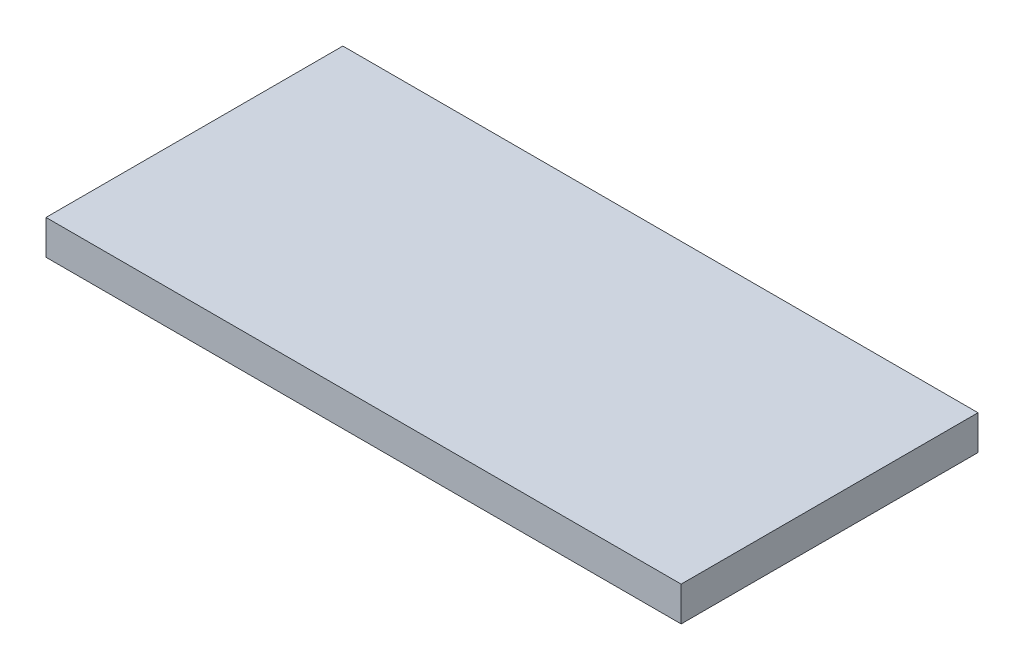
ISO-10303-21;
HEADER;
FILE_DESCRIPTION(('STEP AP214'),'2;1');
FILE_NAME('part.step','',(''),(''),'','','');
FILE_SCHEMA(('AUTOMOTIVE_DESIGN { 1 0 10303 214 1 1 1 1 }'));
ENDSEC;
DATA;
#1=APPLICATION_CONTEXT('core data for automotive mechanical design processes');
#2=APPLICATION_PROTOCOL_DEFINITION('international standard','automotive_design',2000,#1);
#3=PRODUCT_CONTEXT('',#1,'mechanical');
#4=PRODUCT('Part','Part','',(#3));
#5=PRODUCT_RELATED_PRODUCT_CATEGORY('part','',(#4));
#6=PRODUCT_DEFINITION_FORMATION('','',#4);
#7=PRODUCT_DEFINITION_CONTEXT('part definition',#1,'design');
#8=PRODUCT_DEFINITION('design','',#6,#7);
#9=PRODUCT_DEFINITION_SHAPE('','',#8);
#10=(LENGTH_UNIT() NAMED_UNIT(*) SI_UNIT(.MILLI.,.METRE.));
#11=(NAMED_UNIT(*) PLANE_ANGLE_UNIT() SI_UNIT($,.RADIAN.));
#12=(NAMED_UNIT(*) SI_UNIT($,.STERADIAN.) SOLID_ANGLE_UNIT());
#13=UNCERTAINTY_MEASURE_WITH_UNIT(LENGTH_MEASURE(1.E-05),#10,'distance_accuracy_value','');
#14=(GEOMETRIC_REPRESENTATION_CONTEXT(3) GLOBAL_UNCERTAINTY_ASSIGNED_CONTEXT((#13)) GLOBAL_UNIT_ASSIGNED_CONTEXT((#10,
#11,#12)) REPRESENTATION_CONTEXT('',''));
#15=CARTESIAN_POINT('',(0.,0.,0.));
#16=DIRECTION('',(0.,0.,1.));
#17=DIRECTION('',(1.,0.,0.));
#18=AXIS2_PLACEMENT_3D('',#15,#16,#17);
#19=CARTESIAN_POINT('',(92.,10.,-43.));
#20=DIRECTION('',(1.,0.,0.));
#21=DIRECTION('',(0.,0.,-1.));
#22=AXIS2_PLACEMENT_3D('',#19,#20,#21);
#23=PLANE('',#22);
#24=DIRECTION('',(0.,0.,1.));
#25=VECTOR('',#24,1.);
#26=CARTESIAN_POINT('',(92.,0.,-43.));
#27=LINE('',#26,#25);
#28=CARTESIAN_POINT('',(92.,0.,-43.));
#29=VERTEX_POINT('',#28);
#30=CARTESIAN_POINT('',(92.,0.,43.));
#31=VERTEX_POINT('',#30);
#32=EDGE_CURVE('E99',#29,#31,#27,.T.);
#33=ORIENTED_EDGE('',*,*,#32,.F.);
#34=DIRECTION('',(0.,-1.,0.));
#35=VECTOR('',#34,1.);
#36=CARTESIAN_POINT('',(92.,10.,-43.));
#37=LINE('',#36,#35);
#38=CARTESIAN_POINT('',(92.,10.,-43.));
#39=VERTEX_POINT('',#38);
#40=EDGE_CURVE('E11',#39,#29,#37,.T.);
#41=ORIENTED_EDGE('',*,*,#40,.F.);
#42=DIRECTION('',(0.,0.,1.));
#43=VECTOR('',#42,1.);
#44=CARTESIAN_POINT('',(92.,10.,-43.));
#45=LINE('',#44,#43);
#46=CARTESIAN_POINT('',(92.,10.,43.));
#47=VERTEX_POINT('',#46);
#48=EDGE_CURVE('E93',#39,#47,#45,.T.);
#49=ORIENTED_EDGE('',*,*,#48,.T.);
#50=DIRECTION('',(0.,-1.,0.));
#51=VECTOR('',#50,1.);
#52=CARTESIAN_POINT('',(92.,10.,43.));
#53=LINE('',#52,#51);
#54=EDGE_CURVE('E36',#47,#31,#53,.T.);
#55=ORIENTED_EDGE('',*,*,#54,.T.);
#56=EDGE_LOOP('',(#33,#41,#49,#55));
#57=FACE_BOUND('',#56,.T.);
#58=ADVANCED_FACE('F33',(#57),#23,.T.);
#59=CARTESIAN_POINT('',(92.,10.,-43.));
#60=DIRECTION('',(0.,0.,1.));
#61=DIRECTION('',(1.,0.,0.));
#62=AXIS2_PLACEMENT_3D('',#59,#60,#61);
#63=PLANE('',#62);
#64=DIRECTION('',(-1.,0.,0.));
#65=VECTOR('',#64,1.);
#66=CARTESIAN_POINT('',(92.,0.,-43.));
#67=LINE('',#66,#65);
#68=CARTESIAN_POINT('',(-92.,0.,-43.));
#69=VERTEX_POINT('',#68);
#70=EDGE_CURVE('E66',#29,#69,#67,.T.);
#71=ORIENTED_EDGE('',*,*,#70,.T.);
#72=DIRECTION('',(0.,-1.,0.));
#73=VECTOR('',#72,1.);
#74=CARTESIAN_POINT('',(-92.,10.,-43.));
#75=LINE('',#74,#73);
#76=CARTESIAN_POINT('',(-92.,10.,-43.));
#77=VERTEX_POINT('',#76);
#78=EDGE_CURVE('E42',#77,#69,#75,.T.);
#79=ORIENTED_EDGE('',*,*,#78,.F.);
#80=DIRECTION('',(-1.,0.,0.));
#81=VECTOR('',#80,1.);
#82=CARTESIAN_POINT('',(92.,10.,-43.));
#83=LINE('',#82,#81);
#84=EDGE_CURVE('E83',#39,#77,#83,.T.);
#85=ORIENTED_EDGE('',*,*,#84,.F.);
#86=ORIENTED_EDGE('',*,*,#40,.T.);
#87=EDGE_LOOP('',(#71,#79,#85,#86));
#88=FACE_BOUND('',#87,.T.);
#89=ADVANCED_FACE('F110',(#88),#63,.F.);
#90=CARTESIAN_POINT('',(-92.,10.,-43.));
#91=DIRECTION('',(1.,0.,0.));
#92=DIRECTION('',(0.,0.,-1.));
#93=AXIS2_PLACEMENT_3D('',#90,#91,#92);
#94=PLANE('',#93);
#95=DIRECTION('',(0.,0.,1.));
#96=VECTOR('',#95,1.);
#97=CARTESIAN_POINT('',(-92.,0.,-43.));
#98=LINE('',#97,#96);
#99=CARTESIAN_POINT('',(-92.,0.,43.));
#100=VERTEX_POINT('',#99);
#101=EDGE_CURVE('E90',#69,#100,#98,.T.);
#102=ORIENTED_EDGE('',*,*,#101,.T.);
#103=DIRECTION('',(0.,-1.,0.));
#104=VECTOR('',#103,1.);
#105=CARTESIAN_POINT('',(-92.,10.,43.));
#106=LINE('',#105,#104);
#107=CARTESIAN_POINT('',(-92.,10.,43.));
#108=VERTEX_POINT('',#107);
#109=EDGE_CURVE('E87',#108,#100,#106,.T.);
#110=ORIENTED_EDGE('',*,*,#109,.F.);
#111=DIRECTION('',(0.,0.,1.));
#112=VECTOR('',#111,1.);
#113=CARTESIAN_POINT('',(-92.,10.,-43.));
#114=LINE('',#113,#112);
#115=EDGE_CURVE('E78',#77,#108,#114,.T.);
#116=ORIENTED_EDGE('',*,*,#115,.F.);
#117=ORIENTED_EDGE('',*,*,#78,.T.);
#118=EDGE_LOOP('',(#102,#110,#116,#117));
#119=FACE_BOUND('',#118,.T.);
#120=ADVANCED_FACE('F88',(#119),#94,.F.);
#121=CARTESIAN_POINT('',(92.,10.,43.));
#122=DIRECTION('',(0.,0.,1.));
#123=DIRECTION('',(1.,0.,0.));
#124=AXIS2_PLACEMENT_3D('',#121,#122,#123);
#125=PLANE('',#124);
#126=DIRECTION('',(-1.,0.,0.));
#127=VECTOR('',#126,1.);
#128=CARTESIAN_POINT('',(92.,0.,43.));
#129=LINE('',#128,#127);
#130=EDGE_CURVE('E102',#31,#100,#129,.T.);
#131=ORIENTED_EDGE('',*,*,#130,.F.);
#132=ORIENTED_EDGE('',*,*,#54,.F.);
#133=DIRECTION('',(-1.,0.,0.));
#134=VECTOR('',#133,1.);
#135=CARTESIAN_POINT('',(92.,10.,43.));
#136=LINE('',#135,#134);
#137=EDGE_CURVE('E82',#47,#108,#136,.T.);
#138=ORIENTED_EDGE('',*,*,#137,.T.);
#139=ORIENTED_EDGE('',*,*,#109,.T.);
#140=EDGE_LOOP('',(#131,#132,#138,#139));
#141=FACE_BOUND('',#140,.T.);
#142=ADVANCED_FACE('F92',(#141),#125,.T.);
#143=CARTESIAN_POINT('',(0.,10.,0.));
#144=DIRECTION('',(0.,-1.,0.));
#145=DIRECTION('',(0.,0.,-1.));
#146=AXIS2_PLACEMENT_3D('',#143,#144,#145);
#147=PLANE('',#146);
#148=ORIENTED_EDGE('',*,*,#48,.F.);
#149=ORIENTED_EDGE('',*,*,#84,.T.);
#150=ORIENTED_EDGE('',*,*,#115,.T.);
#151=ORIENTED_EDGE('',*,*,#137,.F.);
#152=EDGE_LOOP('',(#148,#149,#150,#151));
#153=FACE_BOUND('',#152,.T.);
#154=ADVANCED_FACE('F81',(#153),#147,.F.);
#155=CARTESIAN_POINT('',(0.,0.,0.));
#156=DIRECTION('',(0.,-1.,0.));
#157=DIRECTION('',(0.,0.,-1.));
#158=AXIS2_PLACEMENT_3D('',#155,#156,#157);
#159=PLANE('',#158);
#160=CARTESIAN_POINT('',(0.,0.,0.));
#161=DIRECTION('',(0.,-1.,0.));
#162=DIRECTION('',(0.,0.,-1.));
#163=AXIS2_PLACEMENT_3D('',#160,#161,#162);
#164=CIRCLE('',#163,5.8);
#165=CARTESIAN_POINT('',(0.,0.,-5.8));
#166=VERTEX_POINT('',#165);
#167=EDGE_CURVE('E141',#166,#166,#164,.T.);
#168=ORIENTED_EDGE('',*,*,#167,.F.);
#169=EDGE_LOOP('',(#168));
#170=FACE_BOUND('',#169,.T.);
#171=ORIENTED_EDGE('',*,*,#32,.T.);
#172=ORIENTED_EDGE('',*,*,#130,.T.);
#173=ORIENTED_EDGE('',*,*,#101,.F.);
#174=ORIENTED_EDGE('',*,*,#70,.F.);
#175=EDGE_LOOP('',(#171,#172,#173,#174));
#176=FACE_BOUND('',#175,.T.);
#177=ADVANCED_FACE('F108',(#170,#176),#159,.T.);
#178=CARTESIAN_POINT('',(0.,5.2,0.));
#179=DIRECTION('',(0.,-1.,0.));
#180=DIRECTION('',(0.,0.,-1.));
#181=AXIS2_PLACEMENT_3D('',#178,#179,#180);
#182=CYLINDRICAL_SURFACE('',#181,5.8);
#183=CARTESIAN_POINT('',(0.,5.2,0.));
#184=DIRECTION('',(0.,-1.,0.));
#185=DIRECTION('',(0.,0.,-1.));
#186=AXIS2_PLACEMENT_3D('',#183,#184,#185);
#187=CIRCLE('',#186,5.8);
#188=CARTESIAN_POINT('',(0.,5.2,-5.8));
#189=VERTEX_POINT('',#188);
#190=EDGE_CURVE('E103',#189,#189,#187,.T.);
#191=ORIENTED_EDGE('',*,*,#190,.F.);
#192=EDGE_LOOP('',(#191));
#193=FACE_BOUND('',#192,.T.);
#194=ORIENTED_EDGE('',*,*,#167,.T.);
#195=EDGE_LOOP('',(#194));
#196=FACE_BOUND('',#195,.T.);
#197=ADVANCED_FACE('F128',(#193,#196),#182,.F.);
#198=CARTESIAN_POINT('',(0.,5.2,0.));
#199=DIRECTION('',(0.,-1.,0.));
#200=DIRECTION('',(0.,0.,-1.));
#201=AXIS2_PLACEMENT_3D('',#198,#199,#200);
#202=PLANE('',#201);
#203=ORIENTED_EDGE('',*,*,#190,.T.);
#204=EDGE_LOOP('',(#203));
#205=FACE_BOUND('',#204,.T.);
#206=ADVANCED_FACE('F133',(#205),#202,.T.);
#207=CLOSED_SHELL('',(#58,#89,#120,#142,#154,#177,#197,#206));
#208=MANIFOLD_SOLID_BREP('B2',#207);
#209=ADVANCED_BREP_SHAPE_REPRESENTATION('',(#18,#208),#14);
#210=SHAPE_DEFINITION_REPRESENTATION(#9,#209);
ENDSEC;
END-ISO-10303-21;
